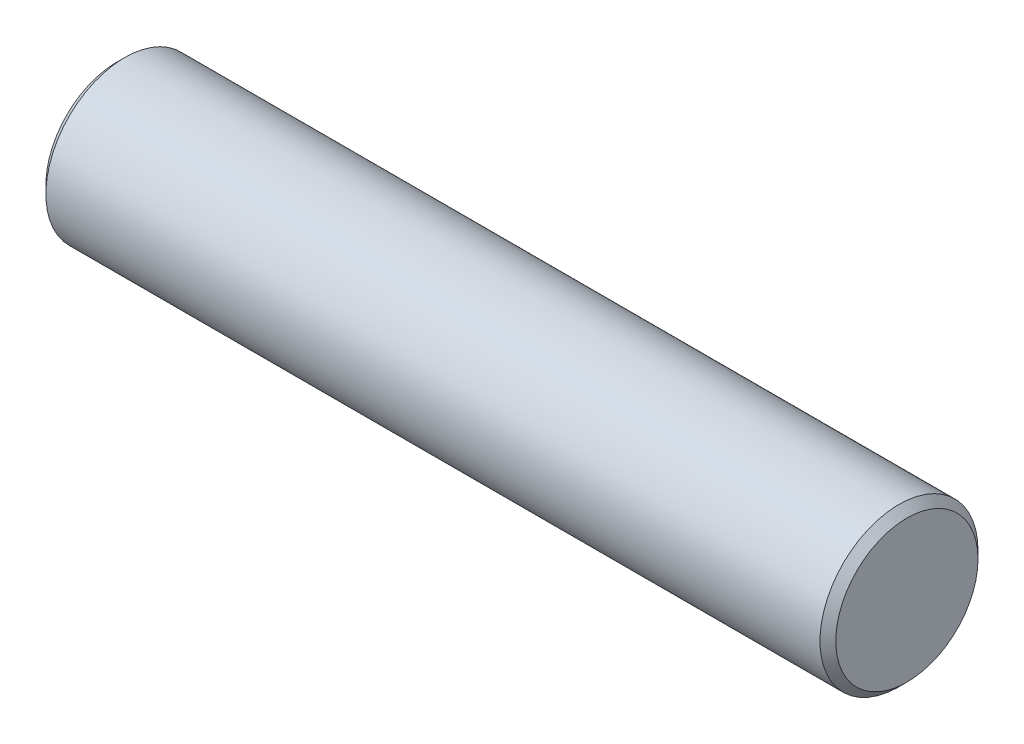
ISO-10303-21;
HEADER;
FILE_DESCRIPTION(('STEP AP214'),'2;1');
FILE_NAME('part.step','',(''),(''),'','','');
FILE_SCHEMA(('AUTOMOTIVE_DESIGN { 1 0 10303 214 1 1 1 1 }'));
ENDSEC;
DATA;
#1=APPLICATION_CONTEXT('core data for automotive mechanical design processes');
#2=APPLICATION_PROTOCOL_DEFINITION('international standard','automotive_design',2000,#1);
#3=PRODUCT_CONTEXT('',#1,'mechanical');
#4=PRODUCT('Part','Part','',(#3));
#5=PRODUCT_RELATED_PRODUCT_CATEGORY('part','',(#4));
#6=PRODUCT_DEFINITION_FORMATION('','',#4);
#7=PRODUCT_DEFINITION_CONTEXT('part definition',#1,'design');
#8=PRODUCT_DEFINITION('design','',#6,#7);
#9=PRODUCT_DEFINITION_SHAPE('','',#8);
#10=(LENGTH_UNIT() NAMED_UNIT(*) SI_UNIT(.MILLI.,.METRE.));
#11=(NAMED_UNIT(*) PLANE_ANGLE_UNIT() SI_UNIT($,.RADIAN.));
#12=(NAMED_UNIT(*) SI_UNIT($,.STERADIAN.) SOLID_ANGLE_UNIT());
#13=UNCERTAINTY_MEASURE_WITH_UNIT(LENGTH_MEASURE(1.E-05),#10,'distance_accuracy_value','');
#14=(GEOMETRIC_REPRESENTATION_CONTEXT(3) GLOBAL_UNCERTAINTY_ASSIGNED_CONTEXT((#13)) GLOBAL_UNIT_ASSIGNED_CONTEXT((#10,
#11,#12)) REPRESENTATION_CONTEXT('',''));
#15=CARTESIAN_POINT('',(0.,0.,0.));
#16=DIRECTION('',(0.,0.,1.));
#17=DIRECTION('',(1.,0.,0.));
#18=AXIS2_PLACEMENT_3D('',#15,#16,#17);
#19=CARTESIAN_POINT('',(100.,0.,0.));
#20=DIRECTION('',(-1.,0.,0.));
#21=DIRECTION('',(0.,0.,1.));
#22=AXIS2_PLACEMENT_3D('',#19,#20,#21);
#23=CYLINDRICAL_SURFACE('',#22,10.);
#24=CARTESIAN_POINT('',(1.00000000000001,0.,0.));
#25=DIRECTION('',(1.,0.,0.));
#26=DIRECTION('',(0.,0.,-1.));
#27=AXIS2_PLACEMENT_3D('',#24,#25,#26);
#28=CIRCLE('',#27,10.);
#29=CARTESIAN_POINT('',(1.00000000000001,0.,-10.));
#30=VERTEX_POINT('',#29);
#31=EDGE_CURVE('E59',#30,#30,#28,.T.);
#32=ORIENTED_EDGE('',*,*,#31,.T.);
#33=EDGE_LOOP('',(#32));
#34=FACE_BOUND('',#33,.T.);
#35=CARTESIAN_POINT('',(99.,0.,0.));
#36=DIRECTION('',(1.,0.,0.));
#37=DIRECTION('',(0.,0.,-1.));
#38=AXIS2_PLACEMENT_3D('',#35,#36,#37);
#39=CIRCLE('',#38,10.);
#40=CARTESIAN_POINT('',(99.,0.,-10.));
#41=VERTEX_POINT('',#40);
#42=EDGE_CURVE('E64',#41,#41,#39,.F.);
#43=ORIENTED_EDGE('',*,*,#42,.T.);
#44=EDGE_LOOP('',(#43));
#45=FACE_BOUND('',#44,.T.);
#46=ADVANCED_FACE('F45',(#34,#45),#23,.T.);
#47=CARTESIAN_POINT('',(100.,0.,0.));
#48=DIRECTION('',(1.,0.,0.));
#49=DIRECTION('',(0.,0.,-1.));
#50=AXIS2_PLACEMENT_3D('',#47,#48,#49);
#51=PLANE('',#50);
#52=CARTESIAN_POINT('',(100.,0.,0.));
#53=DIRECTION('',(1.,0.,0.));
#54=DIRECTION('',(0.,0.,-1.));
#55=AXIS2_PLACEMENT_3D('',#52,#53,#54);
#56=CIRCLE('',#55,8.99999999999998);
#57=CARTESIAN_POINT('',(100.,0.,-8.99999999999998));
#58=VERTEX_POINT('',#57);
#59=EDGE_CURVE('E10',#58,#58,#56,.T.);
#60=ORIENTED_EDGE('',*,*,#59,.T.);
#61=EDGE_LOOP('',(#60));
#62=FACE_BOUND('',#61,.T.);
#63=ADVANCED_FACE('F81',(#62),#51,.T.);
#64=CARTESIAN_POINT('',(0.,0.,0.));
#65=DIRECTION('',(1.,0.,0.));
#66=DIRECTION('',(0.,0.,-1.));
#67=AXIS2_PLACEMENT_3D('',#64,#65,#66);
#68=PLANE('',#67);
#69=CARTESIAN_POINT('',(0.,0.,0.));
#70=DIRECTION('',(1.,0.,0.));
#71=DIRECTION('',(0.,0.,-1.));
#72=AXIS2_PLACEMENT_3D('',#69,#70,#71);
#73=CIRCLE('',#72,8.99999999999999);
#74=CARTESIAN_POINT('',(0.,0.,-8.99999999999999));
#75=VERTEX_POINT('',#74);
#76=EDGE_CURVE('E54',#75,#75,#73,.F.);
#77=ORIENTED_EDGE('',*,*,#76,.T.);
#78=EDGE_LOOP('',(#77));
#79=FACE_BOUND('',#78,.T.);
#80=ADVANCED_FACE('F78',(#79),#68,.F.);
#81=CARTESIAN_POINT('',(1.00000000000001,0.,0.));
#82=DIRECTION('',(1.,0.,0.));
#83=DIRECTION('',(0.,0.,-1.));
#84=AXIS2_PLACEMENT_3D('',#81,#82,#83);
#85=CONICAL_SURFACE('',#84,10.,0.785398163397444);
#86=ORIENTED_EDGE('',*,*,#76,.F.);
#87=EDGE_LOOP('',(#86));
#88=FACE_BOUND('',#87,.T.);
#89=ORIENTED_EDGE('',*,*,#31,.F.);
#90=EDGE_LOOP('',(#89));
#91=FACE_BOUND('',#90,.T.);
#92=ADVANCED_FACE('F74',(#88,#91),#85,.T.);
#93=CARTESIAN_POINT('',(100.,0.,0.));
#94=DIRECTION('',(-1.,0.,0.));
#95=DIRECTION('',(0.,0.,1.));
#96=AXIS2_PLACEMENT_3D('',#93,#94,#95);
#97=CONICAL_SURFACE('',#96,8.99999999999998,0.785398163397444);
#98=ORIENTED_EDGE('',*,*,#42,.F.);
#99=EDGE_LOOP('',(#98));
#100=FACE_BOUND('',#99,.T.);
#101=ORIENTED_EDGE('',*,*,#59,.F.);
#102=EDGE_LOOP('',(#101));
#103=FACE_BOUND('',#102,.T.);
#104=ADVANCED_FACE('F48',(#100,#103),#97,.T.);
#105=CLOSED_SHELL('',(#46,#63,#80,#92,#104));
#106=MANIFOLD_SOLID_BREP('B2',#105);
#107=ADVANCED_BREP_SHAPE_REPRESENTATION('',(#18,#106),#14);
#108=SHAPE_DEFINITION_REPRESENTATION(#9,#107);
ENDSEC;
END-ISO-10303-21;
